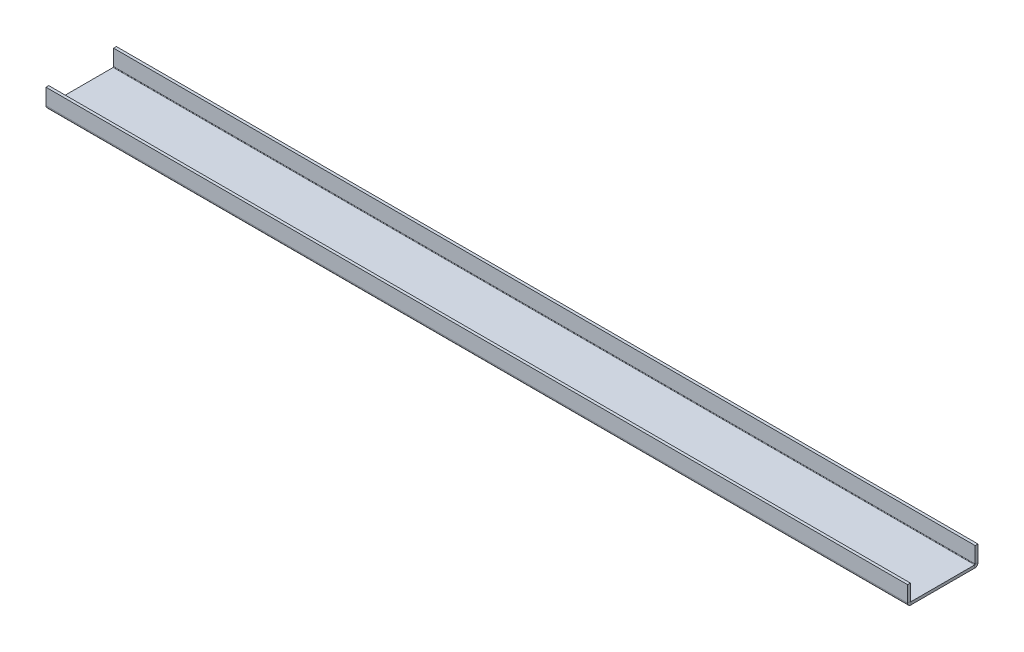
ISO-10303-21;
HEADER;
FILE_DESCRIPTION(('STEP AP214'),'2;1');
FILE_NAME('part.step','',(''),(''),'','','');
FILE_SCHEMA(('AUTOMOTIVE_DESIGN { 1 0 10303 214 1 1 1 1 }'));
ENDSEC;
DATA;
#1=APPLICATION_CONTEXT('core data for automotive mechanical design processes');
#2=APPLICATION_PROTOCOL_DEFINITION('international standard','automotive_design',2000,#1);
#3=PRODUCT_CONTEXT('',#1,'mechanical');
#4=PRODUCT('Part','Part','',(#3));
#5=PRODUCT_RELATED_PRODUCT_CATEGORY('part','',(#4));
#6=PRODUCT_DEFINITION_FORMATION('','',#4);
#7=PRODUCT_DEFINITION_CONTEXT('part definition',#1,'design');
#8=PRODUCT_DEFINITION('design','',#6,#7);
#9=PRODUCT_DEFINITION_SHAPE('','',#8);
#10=(LENGTH_UNIT() NAMED_UNIT(*) SI_UNIT(.MILLI.,.METRE.));
#11=(NAMED_UNIT(*) PLANE_ANGLE_UNIT() SI_UNIT($,.RADIAN.));
#12=(NAMED_UNIT(*) SI_UNIT($,.STERADIAN.) SOLID_ANGLE_UNIT());
#13=UNCERTAINTY_MEASURE_WITH_UNIT(LENGTH_MEASURE(1.E-05),#10,'distance_accuracy_value','');
#14=(GEOMETRIC_REPRESENTATION_CONTEXT(3) GLOBAL_UNCERTAINTY_ASSIGNED_CONTEXT((#13)) GLOBAL_UNIT_ASSIGNED_CONTEXT((#10,
#11,#12)) REPRESENTATION_CONTEXT('',''));
#15=CARTESIAN_POINT('',(0.,0.,0.));
#16=DIRECTION('',(0.,0.,1.));
#17=DIRECTION('',(1.,0.,0.));
#18=AXIS2_PLACEMENT_3D('',#15,#16,#17);
#19=CARTESIAN_POINT('',(431.8,0.25,-32.5));
#20=DIRECTION('',(1.,0.,0.));
#21=DIRECTION('',(0.,0.,-1.));
#22=AXIS2_PLACEMENT_3D('',#19,#20,#21);
#23=PLANE('',#22);
#24=DIRECTION('',(0.,0.,-1.));
#25=VECTOR('',#24,1.);
#26=CARTESIAN_POINT('',(431.8,0.25,-32.5));
#27=LINE('',#26,#25);
#28=CARTESIAN_POINT('',(431.8,0.25,-32.5));
#29=VERTEX_POINT('',#28);
#30=CARTESIAN_POINT('',(431.8,0.25,-33.9));
#31=VERTEX_POINT('',#30);
#32=EDGE_CURVE('E11',#29,#31,#27,.T.);
#33=ORIENTED_EDGE('',*,*,#32,.F.);
#34=CARTESIAN_POINT('',(431.8,0.25,-32.25));
#35=DIRECTION('',(1.,0.,0.));
#36=DIRECTION('',(0.,0.,-1.));
#37=AXIS2_PLACEMENT_3D('',#34,#35,#36);
#38=CIRCLE('',#37,0.25);
#39=CARTESIAN_POINT('',(431.8,0.,-32.25));
#40=VERTEX_POINT('',#39);
#41=EDGE_CURVE('E149',#29,#40,#38,.F.);
#42=ORIENTED_EDGE('',*,*,#41,.T.);
#43=DIRECTION('',(0.,1.,0.));
#44=VECTOR('',#43,1.);
#45=CARTESIAN_POINT('',(431.8,-1.4,-32.25));
#46=LINE('',#45,#44);
#47=CARTESIAN_POINT('',(431.8,-1.4,-32.25));
#48=VERTEX_POINT('',#47);
#49=EDGE_CURVE('E47',#48,#40,#46,.T.);
#50=ORIENTED_EDGE('',*,*,#49,.F.);
#51=CARTESIAN_POINT('',(431.8,0.25,-32.25));
#52=DIRECTION('',(1.,0.,0.));
#53=DIRECTION('',(0.,0.,-1.));
#54=AXIS2_PLACEMENT_3D('',#51,#52,#53);
#55=CIRCLE('',#54,1.65);
#56=EDGE_CURVE('E243',#31,#48,#55,.F.);
#57=ORIENTED_EDGE('',*,*,#56,.F.);
#58=EDGE_LOOP('',(#33,#42,#50,#57));
#59=FACE_BOUND('',#58,.T.);
#60=ADVANCED_FACE('F39',(#59),#23,.T.);
#61=CARTESIAN_POINT('',(431.8,-1.4,-32.25));
#62=DIRECTION('',(1.,0.,0.));
#63=DIRECTION('',(0.,0.,-1.));
#64=AXIS2_PLACEMENT_3D('',#61,#62,#63);
#65=PLANE('',#64);
#66=DIRECTION('',(0.,-1.,0.));
#67=VECTOR('',#66,1.);
#68=CARTESIAN_POINT('',(431.8,0.,-32.5));
#69=LINE('',#68,#67);
#70=CARTESIAN_POINT('',(431.8,8.25,-32.5));
#71=VERTEX_POINT('',#70);
#72=EDGE_CURVE('E154',#71,#29,#69,.T.);
#73=ORIENTED_EDGE('',*,*,#72,.T.);
#74=ORIENTED_EDGE('',*,*,#32,.T.);
#75=DIRECTION('',(0.,1.,0.));
#76=VECTOR('',#75,1.);
#77=CARTESIAN_POINT('',(431.8,0.,-33.9));
#78=LINE('',#77,#76);
#79=CARTESIAN_POINT('',(431.8,8.25,-33.9));
#80=VERTEX_POINT('',#79);
#81=EDGE_CURVE('E256',#80,#31,#78,.F.);
#82=ORIENTED_EDGE('',*,*,#81,.F.);
#83=DIRECTION('',(0.,0.,-1.));
#84=VECTOR('',#83,1.);
#85=CARTESIAN_POINT('',(431.8,8.25,-32.5));
#86=LINE('',#85,#84);
#87=EDGE_CURVE('E258',#71,#80,#86,.T.);
#88=ORIENTED_EDGE('',*,*,#87,.F.);
#89=EDGE_LOOP('',(#73,#74,#82,#88));
#90=FACE_BOUND('',#89,.T.);
#91=ADVANCED_FACE('F269',(#90),#65,.T.);
#92=CARTESIAN_POINT('',(0.,0.,-32.25));
#93=DIRECTION('',(-1.,0.,0.));
#94=DIRECTION('',(0.,0.,1.));
#95=AXIS2_PLACEMENT_3D('',#92,#93,#94);
#96=PLANE('',#95);
#97=DIRECTION('',(0.,-1.,0.));
#98=VECTOR('',#97,1.);
#99=CARTESIAN_POINT('',(0.,0.,-32.25));
#100=LINE('',#99,#98);
#101=CARTESIAN_POINT('',(0.,0.,-32.25));
#102=VERTEX_POINT('',#101);
#103=CARTESIAN_POINT('',(0.,-1.4,-32.25));
#104=VERTEX_POINT('',#103);
#105=EDGE_CURVE('E147',#102,#104,#100,.T.);
#106=ORIENTED_EDGE('',*,*,#105,.F.);
#107=CARTESIAN_POINT('',(0.,0.25,-32.25));
#108=DIRECTION('',(1.,0.,0.));
#109=DIRECTION('',(0.,0.,-1.));
#110=AXIS2_PLACEMENT_3D('',#107,#108,#109);
#111=CIRCLE('',#110,0.25);
#112=CARTESIAN_POINT('',(0.,0.25,-32.5));
#113=VERTEX_POINT('',#112);
#114=EDGE_CURVE('E161',#113,#102,#111,.F.);
#115=ORIENTED_EDGE('',*,*,#114,.F.);
#116=DIRECTION('',(0.,0.,1.));
#117=VECTOR('',#116,1.);
#118=CARTESIAN_POINT('',(0.,0.25,-33.9));
#119=LINE('',#118,#117);
#120=CARTESIAN_POINT('',(0.,0.25,-33.9));
#121=VERTEX_POINT('',#120);
#122=EDGE_CURVE('E234',#121,#113,#119,.T.);
#123=ORIENTED_EDGE('',*,*,#122,.F.);
#124=CARTESIAN_POINT('',(0.,0.25,-32.25));
#125=DIRECTION('',(1.,0.,0.));
#126=DIRECTION('',(0.,0.,-1.));
#127=AXIS2_PLACEMENT_3D('',#124,#125,#126);
#128=CIRCLE('',#127,1.65);
#129=EDGE_CURVE('E188',#121,#104,#128,.F.);
#130=ORIENTED_EDGE('',*,*,#129,.T.);
#131=EDGE_LOOP('',(#106,#115,#123,#130));
#132=FACE_BOUND('',#131,.T.);
#133=ADVANCED_FACE('F248',(#132),#96,.T.);
#134=CARTESIAN_POINT('',(0.,0.25,-33.9));
#135=DIRECTION('',(-1.,0.,0.));
#136=DIRECTION('',(0.,0.,1.));
#137=AXIS2_PLACEMENT_3D('',#134,#135,#136);
#138=PLANE('',#137);
#139=DIRECTION('',(0.,0.,1.));
#140=VECTOR('',#139,1.);
#141=CARTESIAN_POINT('',(0.,0.,0.));
#142=LINE('',#141,#140);
#143=CARTESIAN_POINT('',(0.,0.,-0.25));
#144=VERTEX_POINT('',#143);
#145=EDGE_CURVE('E201',#102,#144,#142,.T.);
#146=ORIENTED_EDGE('',*,*,#145,.F.);
#147=ORIENTED_EDGE('',*,*,#105,.T.);
#148=DIRECTION('',(0.,0.,-1.));
#149=VECTOR('',#148,1.);
#150=CARTESIAN_POINT('',(0.,-1.4,0.));
#151=LINE('',#150,#149);
#152=CARTESIAN_POINT('',(0.,-1.4,-0.25));
#153=VERTEX_POINT('',#152);
#154=EDGE_CURVE('E186',#104,#153,#151,.F.);
#155=ORIENTED_EDGE('',*,*,#154,.T.);
#156=DIRECTION('',(0.,1.,0.));
#157=VECTOR('',#156,1.);
#158=CARTESIAN_POINT('',(0.,-1.4,-0.25));
#159=LINE('',#158,#157);
#160=EDGE_CURVE('E96',#153,#144,#159,.T.);
#161=ORIENTED_EDGE('',*,*,#160,.T.);
#162=EDGE_LOOP('',(#146,#147,#155,#161));
#163=FACE_BOUND('',#162,.T.);
#164=ADVANCED_FACE('F236',(#163),#138,.T.);
#165=CARTESIAN_POINT('',(431.8,0.,-0.25));
#166=DIRECTION('',(1.,0.,0.));
#167=DIRECTION('',(0.,0.,-1.));
#168=AXIS2_PLACEMENT_3D('',#165,#166,#167);
#169=PLANE('',#168);
#170=DIRECTION('',(0.,-1.,0.));
#171=VECTOR('',#170,1.);
#172=CARTESIAN_POINT('',(431.8,0.,-0.25));
#173=LINE('',#172,#171);
#174=CARTESIAN_POINT('',(431.8,0.,-0.25));
#175=VERTEX_POINT('',#174);
#176=CARTESIAN_POINT('',(431.8,-1.4,-0.25));
#177=VERTEX_POINT('',#176);
#178=EDGE_CURVE('E232',#175,#177,#173,.T.);
#179=ORIENTED_EDGE('',*,*,#178,.F.);
#180=CARTESIAN_POINT('',(431.8,0.25,-0.25));
#181=DIRECTION('',(1.,0.,0.));
#182=DIRECTION('',(0.,0.,-1.));
#183=AXIS2_PLACEMENT_3D('',#180,#181,#182);
#184=CIRCLE('',#183,0.25);
#185=CARTESIAN_POINT('',(431.8,0.25,0.));
#186=VERTEX_POINT('',#185);
#187=EDGE_CURVE('E169',#175,#186,#184,.F.);
#188=ORIENTED_EDGE('',*,*,#187,.T.);
#189=DIRECTION('',(0.,0.,-1.));
#190=VECTOR('',#189,1.);
#191=CARTESIAN_POINT('',(431.8,0.25,1.4));
#192=LINE('',#191,#190);
#193=CARTESIAN_POINT('',(431.8,0.25,1.4));
#194=VERTEX_POINT('',#193);
#195=EDGE_CURVE('E55',#194,#186,#192,.T.);
#196=ORIENTED_EDGE('',*,*,#195,.F.);
#197=CARTESIAN_POINT('',(431.8,0.25,-0.25));
#198=DIRECTION('',(1.,0.,0.));
#199=DIRECTION('',(0.,0.,-1.));
#200=AXIS2_PLACEMENT_3D('',#197,#198,#199);
#201=CIRCLE('',#200,1.65);
#202=EDGE_CURVE('E260',#177,#194,#201,.F.);
#203=ORIENTED_EDGE('',*,*,#202,.F.);
#204=EDGE_LOOP('',(#179,#188,#196,#203));
#205=FACE_BOUND('',#204,.T.);
#206=ADVANCED_FACE('F295',(#205),#169,.T.);
#207=CARTESIAN_POINT('',(431.8,0.25,1.4));
#208=DIRECTION('',(1.,0.,0.));
#209=DIRECTION('',(0.,0.,-1.));
#210=AXIS2_PLACEMENT_3D('',#207,#208,#209);
#211=PLANE('',#210);
#212=DIRECTION('',(0.,0.,1.));
#213=VECTOR('',#212,1.);
#214=CARTESIAN_POINT('',(431.8,0.,0.));
#215=LINE('',#214,#213);
#216=EDGE_CURVE('E139',#40,#175,#215,.T.);
#217=ORIENTED_EDGE('',*,*,#216,.T.);
#218=ORIENTED_EDGE('',*,*,#178,.T.);
#219=DIRECTION('',(0.,0.,-1.));
#220=VECTOR('',#219,1.);
#221=CARTESIAN_POINT('',(431.8,-1.4,0.));
#222=LINE('',#221,#220);
#223=EDGE_CURVE('E142',#48,#177,#222,.F.);
#224=ORIENTED_EDGE('',*,*,#223,.F.);
#225=ORIENTED_EDGE('',*,*,#49,.T.);
#226=EDGE_LOOP('',(#217,#218,#224,#225));
#227=FACE_BOUND('',#226,.T.);
#228=ADVANCED_FACE('F137',(#227),#211,.T.);
#229=CARTESIAN_POINT('',(0.,0.25,0.));
#230=DIRECTION('',(-1.,0.,0.));
#231=DIRECTION('',(0.,0.,1.));
#232=AXIS2_PLACEMENT_3D('',#229,#230,#231);
#233=PLANE('',#232);
#234=DIRECTION('',(0.,0.,1.));
#235=VECTOR('',#234,1.);
#236=CARTESIAN_POINT('',(0.,0.25,0.));
#237=LINE('',#236,#235);
#238=CARTESIAN_POINT('',(0.,0.25,0.));
#239=VERTEX_POINT('',#238);
#240=CARTESIAN_POINT('',(0.,0.25,1.4));
#241=VERTEX_POINT('',#240);
#242=EDGE_CURVE('E103',#239,#241,#237,.T.);
#243=ORIENTED_EDGE('',*,*,#242,.F.);
#244=CARTESIAN_POINT('',(0.,0.25,-0.25));
#245=DIRECTION('',(1.,0.,0.));
#246=DIRECTION('',(0.,0.,-1.));
#247=AXIS2_PLACEMENT_3D('',#244,#245,#246);
#248=CIRCLE('',#247,0.25);
#249=EDGE_CURVE('E203',#144,#239,#248,.F.);
#250=ORIENTED_EDGE('',*,*,#249,.F.);
#251=ORIENTED_EDGE('',*,*,#160,.F.);
#252=CARTESIAN_POINT('',(0.,0.25,-0.25));
#253=DIRECTION('',(1.,0.,0.));
#254=DIRECTION('',(0.,0.,-1.));
#255=AXIS2_PLACEMENT_3D('',#252,#253,#254);
#256=CIRCLE('',#255,1.65);
#257=EDGE_CURVE('E184',#153,#241,#256,.F.);
#258=ORIENTED_EDGE('',*,*,#257,.T.);
#259=EDGE_LOOP('',(#243,#250,#251,#258));
#260=FACE_BOUND('',#259,.T.);
#261=ADVANCED_FACE('F301',(#260),#233,.T.);
#262=CARTESIAN_POINT('',(0.,-1.4,-0.25));
#263=DIRECTION('',(-1.,0.,0.));
#264=DIRECTION('',(0.,0.,1.));
#265=AXIS2_PLACEMENT_3D('',#262,#263,#264);
#266=PLANE('',#265);
#267=DIRECTION('',(0.,1.,0.));
#268=VECTOR('',#267,1.);
#269=CARTESIAN_POINT('',(0.,0.,0.));
#270=LINE('',#269,#268);
#271=CARTESIAN_POINT('',(0.,8.25000000000001,0.));
#272=VERTEX_POINT('',#271);
#273=EDGE_CURVE('E175',#239,#272,#270,.T.);
#274=ORIENTED_EDGE('',*,*,#273,.F.);
#275=ORIENTED_EDGE('',*,*,#242,.T.);
#276=DIRECTION('',(0.,1.,0.));
#277=VECTOR('',#276,1.);
#278=CARTESIAN_POINT('',(0.,0.,1.4));
#279=LINE('',#278,#277);
#280=CARTESIAN_POINT('',(0.,8.25000000000001,1.4));
#281=VERTEX_POINT('',#280);
#282=EDGE_CURVE('E181',#241,#281,#279,.T.);
#283=ORIENTED_EDGE('',*,*,#282,.T.);
#284=DIRECTION('',(0.,0.,-1.));
#285=VECTOR('',#284,1.);
#286=CARTESIAN_POINT('',(0.,8.25000000000001,1.4));
#287=LINE('',#286,#285);
#288=EDGE_CURVE('E178',#281,#272,#287,.T.);
#289=ORIENTED_EDGE('',*,*,#288,.T.);
#290=EDGE_LOOP('',(#274,#275,#283,#289));
#291=FACE_BOUND('',#290,.T.);
#292=ADVANCED_FACE('F304',(#291),#266,.T.);
#293=CARTESIAN_POINT('',(431.8,0.,0.));
#294=DIRECTION('',(0.,0.,1.));
#295=DIRECTION('',(1.,0.,0.));
#296=AXIS2_PLACEMENT_3D('',#293,#294,#295);
#297=PLANE('',#296);
#298=ORIENTED_EDGE('',*,*,#273,.T.);
#299=DIRECTION('',(-1.,0.,0.));
#300=VECTOR('',#299,1.);
#301=CARTESIAN_POINT('',(431.8,8.25000000000001,0.));
#302=LINE('',#301,#300);
#303=CARTESIAN_POINT('',(431.8,8.25000000000001,0.));
#304=VERTEX_POINT('',#303);
#305=EDGE_CURVE('E227',#304,#272,#302,.T.);
#306=ORIENTED_EDGE('',*,*,#305,.F.);
#307=DIRECTION('',(0.,1.,0.));
#308=VECTOR('',#307,1.);
#309=CARTESIAN_POINT('',(431.8,0.,0.));
#310=LINE('',#309,#308);
#311=EDGE_CURVE('E109',#186,#304,#310,.T.);
#312=ORIENTED_EDGE('',*,*,#311,.F.);
#313=DIRECTION('',(-1.,0.,0.));
#314=VECTOR('',#313,1.);
#315=CARTESIAN_POINT('',(431.8,0.25,0.));
#316=LINE('',#315,#314);
#317=EDGE_CURVE('E171',#186,#239,#316,.T.);
#318=ORIENTED_EDGE('',*,*,#317,.T.);
#319=EDGE_LOOP('',(#298,#306,#312,#318));
#320=FACE_BOUND('',#319,.T.);
#321=ADVANCED_FACE('F307',(#320),#297,.F.);
#322=CARTESIAN_POINT('',(431.8,8.25000000000001,1.4));
#323=DIRECTION('',(0.,1.,0.));
#324=DIRECTION('',(0.,0.,1.));
#325=AXIS2_PLACEMENT_3D('',#322,#323,#324);
#326=PLANE('',#325);
#327=ORIENTED_EDGE('',*,*,#288,.F.);
#328=DIRECTION('',(-1.,0.,0.));
#329=VECTOR('',#328,1.);
#330=CARTESIAN_POINT('',(431.8,8.25000000000001,1.4));
#331=LINE('',#330,#329);
#332=CARTESIAN_POINT('',(431.8,8.25000000000001,1.4));
#333=VERTEX_POINT('',#332);
#334=EDGE_CURVE('E225',#333,#281,#331,.T.);
#335=ORIENTED_EDGE('',*,*,#334,.F.);
#336=DIRECTION('',(0.,0.,-1.));
#337=VECTOR('',#336,1.);
#338=CARTESIAN_POINT('',(431.8,8.25000000000001,1.4));
#339=LINE('',#338,#337);
#340=EDGE_CURVE('E515',#333,#304,#339,.T.);
#341=ORIENTED_EDGE('',*,*,#340,.T.);
#342=ORIENTED_EDGE('',*,*,#305,.T.);
#343=EDGE_LOOP('',(#327,#335,#341,#342));
#344=FACE_BOUND('',#343,.T.);
#345=ADVANCED_FACE('F311',(#344),#326,.T.);
#346=CARTESIAN_POINT('',(431.8,0.,1.4));
#347=DIRECTION('',(0.,0.,1.));
#348=DIRECTION('',(1.,0.,0.));
#349=AXIS2_PLACEMENT_3D('',#346,#347,#348);
#350=PLANE('',#349);
#351=ORIENTED_EDGE('',*,*,#282,.F.);
#352=DIRECTION('',(-1.,0.,0.));
#353=VECTOR('',#352,1.);
#354=CARTESIAN_POINT('',(431.8,0.25,1.4));
#355=LINE('',#354,#353);
#356=EDGE_CURVE('E222',#194,#241,#355,.T.);
#357=ORIENTED_EDGE('',*,*,#356,.F.);
#358=DIRECTION('',(0.,1.,0.));
#359=VECTOR('',#358,1.);
#360=CARTESIAN_POINT('',(431.8,0.,1.4));
#361=LINE('',#360,#359);
#362=EDGE_CURVE('E517',#194,#333,#361,.T.);
#363=ORIENTED_EDGE('',*,*,#362,.T.);
#364=ORIENTED_EDGE('',*,*,#334,.T.);
#365=EDGE_LOOP('',(#351,#357,#363,#364));
#366=FACE_BOUND('',#365,.T.);
#367=ADVANCED_FACE('F315',(#366),#350,.T.);
#368=CARTESIAN_POINT('',(431.8,0.25,-0.25));
#369=DIRECTION('',(-1.,0.,0.));
#370=DIRECTION('',(0.,0.,1.));
#371=AXIS2_PLACEMENT_3D('',#368,#369,#370);
#372=CYLINDRICAL_SURFACE('',#371,1.65);
#373=ORIENTED_EDGE('',*,*,#257,.F.);
#374=DIRECTION('',(-1.,0.,0.));
#375=VECTOR('',#374,1.);
#376=CARTESIAN_POINT('',(431.8,-1.4,-0.25));
#377=LINE('',#376,#375);
#378=EDGE_CURVE('E219',#177,#153,#377,.T.);
#379=ORIENTED_EDGE('',*,*,#378,.F.);
#380=ORIENTED_EDGE('',*,*,#202,.T.);
#381=ORIENTED_EDGE('',*,*,#356,.T.);
#382=EDGE_LOOP('',(#373,#379,#380,#381));
#383=FACE_BOUND('',#382,.T.);
#384=ADVANCED_FACE('F319',(#383),#372,.T.);
#385=CARTESIAN_POINT('',(431.8,-1.4,0.));
#386=DIRECTION('',(0.,-1.,0.));
#387=DIRECTION('',(0.,0.,-1.));
#388=AXIS2_PLACEMENT_3D('',#385,#386,#387);
#389=PLANE('',#388);
#390=ORIENTED_EDGE('',*,*,#154,.F.);
#391=DIRECTION('',(-1.,0.,0.));
#392=VECTOR('',#391,1.);
#393=CARTESIAN_POINT('',(431.8,-1.4,-32.25));
#394=LINE('',#393,#392);
#395=EDGE_CURVE('E216',#48,#104,#394,.T.);
#396=ORIENTED_EDGE('',*,*,#395,.F.);
#397=ORIENTED_EDGE('',*,*,#223,.T.);
#398=ORIENTED_EDGE('',*,*,#378,.T.);
#399=EDGE_LOOP('',(#390,#396,#397,#398));
#400=FACE_BOUND('',#399,.T.);
#401=ADVANCED_FACE('F245',(#400),#389,.T.);
#402=CARTESIAN_POINT('',(431.8,0.25,-32.25));
#403=DIRECTION('',(-1.,0.,0.));
#404=DIRECTION('',(0.,0.,1.));
#405=AXIS2_PLACEMENT_3D('',#402,#403,#404);
#406=CYLINDRICAL_SURFACE('',#405,1.65);
#407=ORIENTED_EDGE('',*,*,#129,.F.);
#408=DIRECTION('',(-1.,0.,0.));
#409=VECTOR('',#408,1.);
#410=CARTESIAN_POINT('',(431.8,0.25,-33.9));
#411=LINE('',#410,#409);
#412=EDGE_CURVE('E213',#31,#121,#411,.T.);
#413=ORIENTED_EDGE('',*,*,#412,.F.);
#414=ORIENTED_EDGE('',*,*,#56,.T.);
#415=ORIENTED_EDGE('',*,*,#395,.T.);
#416=EDGE_LOOP('',(#407,#413,#414,#415));
#417=FACE_BOUND('',#416,.T.);
#418=ADVANCED_FACE('F241',(#417),#406,.T.);
#419=CARTESIAN_POINT('',(431.8,0.,-33.9));
#420=DIRECTION('',(0.,0.,-1.));
#421=DIRECTION('',(-1.,0.,0.));
#422=AXIS2_PLACEMENT_3D('',#419,#420,#421);
#423=PLANE('',#422);
#424=DIRECTION('',(0.,1.,0.));
#425=VECTOR('',#424,1.);
#426=CARTESIAN_POINT('',(0.,0.,-33.9));
#427=LINE('',#426,#425);
#428=CARTESIAN_POINT('',(0.,8.25,-33.9));
#429=VERTEX_POINT('',#428);
#430=EDGE_CURVE('E191',#429,#121,#427,.F.);
#431=ORIENTED_EDGE('',*,*,#430,.F.);
#432=DIRECTION('',(-1.,0.,0.));
#433=VECTOR('',#432,1.);
#434=CARTESIAN_POINT('',(431.8,8.25,-33.9));
#435=LINE('',#434,#433);
#436=EDGE_CURVE('E211',#80,#429,#435,.T.);
#437=ORIENTED_EDGE('',*,*,#436,.F.);
#438=ORIENTED_EDGE('',*,*,#81,.T.);
#439=ORIENTED_EDGE('',*,*,#412,.T.);
#440=EDGE_LOOP('',(#431,#437,#438,#439));
#441=FACE_BOUND('',#440,.T.);
#442=ADVANCED_FACE('F254',(#441),#423,.T.);
#443=CARTESIAN_POINT('',(431.8,8.25,-32.5));
#444=DIRECTION('',(0.,1.,0.));
#445=DIRECTION('',(0.,0.,1.));
#446=AXIS2_PLACEMENT_3D('',#443,#444,#445);
#447=PLANE('',#446);
#448=DIRECTION('',(0.,0.,-1.));
#449=VECTOR('',#448,1.);
#450=CARTESIAN_POINT('',(0.,8.25,-32.5));
#451=LINE('',#450,#449);
#452=CARTESIAN_POINT('',(0.,8.25,-32.5));
#453=VERTEX_POINT('',#452);
#454=EDGE_CURVE('E194',#453,#429,#451,.T.);
#455=ORIENTED_EDGE('',*,*,#454,.F.);
#456=DIRECTION('',(-1.,0.,0.));
#457=VECTOR('',#456,1.);
#458=CARTESIAN_POINT('',(431.8,8.25,-32.5));
#459=LINE('',#458,#457);
#460=EDGE_CURVE('E209',#71,#453,#459,.T.);
#461=ORIENTED_EDGE('',*,*,#460,.F.);
#462=ORIENTED_EDGE('',*,*,#87,.T.);
#463=ORIENTED_EDGE('',*,*,#436,.T.);
#464=EDGE_LOOP('',(#455,#461,#462,#463));
#465=FACE_BOUND('',#464,.T.);
#466=ADVANCED_FACE('F275',(#465),#447,.T.);
#467=CARTESIAN_POINT('',(431.8,0.,-32.5));
#468=DIRECTION('',(0.,0.,-1.));
#469=DIRECTION('',(-1.,0.,0.));
#470=AXIS2_PLACEMENT_3D('',#467,#468,#469);
#471=PLANE('',#470);
#472=DIRECTION('',(0.,-1.,0.));
#473=VECTOR('',#472,1.);
#474=CARTESIAN_POINT('',(0.,0.,-32.5));
#475=LINE('',#474,#473);
#476=EDGE_CURVE('E197',#453,#113,#475,.T.);
#477=ORIENTED_EDGE('',*,*,#476,.T.);
#478=DIRECTION('',(-1.,0.,0.));
#479=VECTOR('',#478,1.);
#480=CARTESIAN_POINT('',(431.8,0.25,-32.5));
#481=LINE('',#480,#479);
#482=EDGE_CURVE('E163',#29,#113,#481,.T.);
#483=ORIENTED_EDGE('',*,*,#482,.F.);
#484=ORIENTED_EDGE('',*,*,#72,.F.);
#485=ORIENTED_EDGE('',*,*,#460,.T.);
#486=EDGE_LOOP('',(#477,#483,#484,#485));
#487=FACE_BOUND('',#486,.T.);
#488=ADVANCED_FACE('F271',(#487),#471,.F.);
#489=CARTESIAN_POINT('',(431.8,0.25,-32.25));
#490=DIRECTION('',(-1.,0.,0.));
#491=DIRECTION('',(0.,0.,1.));
#492=AXIS2_PLACEMENT_3D('',#489,#490,#491);
#493=CYLINDRICAL_SURFACE('',#492,0.25);
#494=ORIENTED_EDGE('',*,*,#114,.T.);
#495=DIRECTION('',(-1.,0.,0.));
#496=VECTOR('',#495,1.);
#497=CARTESIAN_POINT('',(431.8,0.,-32.25));
#498=LINE('',#497,#496);
#499=EDGE_CURVE('E158',#40,#102,#498,.T.);
#500=ORIENTED_EDGE('',*,*,#499,.F.);
#501=ORIENTED_EDGE('',*,*,#41,.F.);
#502=ORIENTED_EDGE('',*,*,#482,.T.);
#503=EDGE_LOOP('',(#494,#500,#501,#502));
#504=FACE_BOUND('',#503,.T.);
#505=ADVANCED_FACE('F159',(#504),#493,.F.);
#506=CARTESIAN_POINT('',(431.8,0.,0.));
#507=DIRECTION('',(0.,-1.,0.));
#508=DIRECTION('',(0.,0.,-1.));
#509=AXIS2_PLACEMENT_3D('',#506,#507,#508);
#510=PLANE('',#509);
#511=ORIENTED_EDGE('',*,*,#145,.T.);
#512=DIRECTION('',(-1.,0.,0.));
#513=VECTOR('',#512,1.);
#514=CARTESIAN_POINT('',(431.8,0.,-0.25));
#515=LINE('',#514,#513);
#516=EDGE_CURVE('E164',#175,#144,#515,.T.);
#517=ORIENTED_EDGE('',*,*,#516,.F.);
#518=ORIENTED_EDGE('',*,*,#216,.F.);
#519=ORIENTED_EDGE('',*,*,#499,.T.);
#520=EDGE_LOOP('',(#511,#517,#518,#519));
#521=FACE_BOUND('',#520,.T.);
#522=ADVANCED_FACE('F166',(#521),#510,.F.);
#523=CARTESIAN_POINT('',(431.8,0.25,-0.25));
#524=DIRECTION('',(-1.,0.,0.));
#525=DIRECTION('',(0.,0.,1.));
#526=AXIS2_PLACEMENT_3D('',#523,#524,#525);
#527=CYLINDRICAL_SURFACE('',#526,0.25);
#528=ORIENTED_EDGE('',*,*,#249,.T.);
#529=ORIENTED_EDGE('',*,*,#317,.F.);
#530=ORIENTED_EDGE('',*,*,#187,.F.);
#531=ORIENTED_EDGE('',*,*,#516,.T.);
#532=EDGE_LOOP('',(#528,#529,#530,#531));
#533=FACE_BOUND('',#532,.T.);
#534=ADVANCED_FACE('F366',(#533),#527,.F.);
#535=CARTESIAN_POINT('',(431.8,0.25,-0.25));
#536=DIRECTION('',(1.,0.,0.));
#537=DIRECTION('',(0.,0.,-1.));
#538=AXIS2_PLACEMENT_3D('',#535,#536,#537);
#539=PLANE('',#538);
#540=ORIENTED_EDGE('',*,*,#311,.T.);
#541=ORIENTED_EDGE('',*,*,#340,.F.);
#542=ORIENTED_EDGE('',*,*,#362,.F.);
#543=ORIENTED_EDGE('',*,*,#195,.T.);
#544=EDGE_LOOP('',(#540,#541,#542,#543));
#545=FACE_BOUND('',#544,.T.);
#546=ADVANCED_FACE('F376',(#545),#539,.T.);
#547=CARTESIAN_POINT('',(0.,0.25,-0.25));
#548=DIRECTION('',(1.,0.,0.));
#549=DIRECTION('',(0.,0.,-1.));
#550=AXIS2_PLACEMENT_3D('',#547,#548,#549);
#551=PLANE('',#550);
#552=ORIENTED_EDGE('',*,*,#430,.T.);
#553=ORIENTED_EDGE('',*,*,#122,.T.);
#554=ORIENTED_EDGE('',*,*,#476,.F.);
#555=ORIENTED_EDGE('',*,*,#454,.T.);
#556=EDGE_LOOP('',(#552,#553,#554,#555));
#557=FACE_BOUND('',#556,.T.);
#558=ADVANCED_FACE('F273',(#557),#551,.F.);
#559=CLOSED_SHELL('',(#60,#91,#133,#164,#206,#228,#261,#292,#321,#345,#367,#384,#401,#418,#442,
#466,#488,#505,#522,#534,#546,#558));
#560=MANIFOLD_SOLID_BREP('B2',#559);
#561=ADVANCED_BREP_SHAPE_REPRESENTATION('',(#18,#560),#14);
#562=SHAPE_DEFINITION_REPRESENTATION(#9,#561);
ENDSEC;
END-ISO-10303-21;
